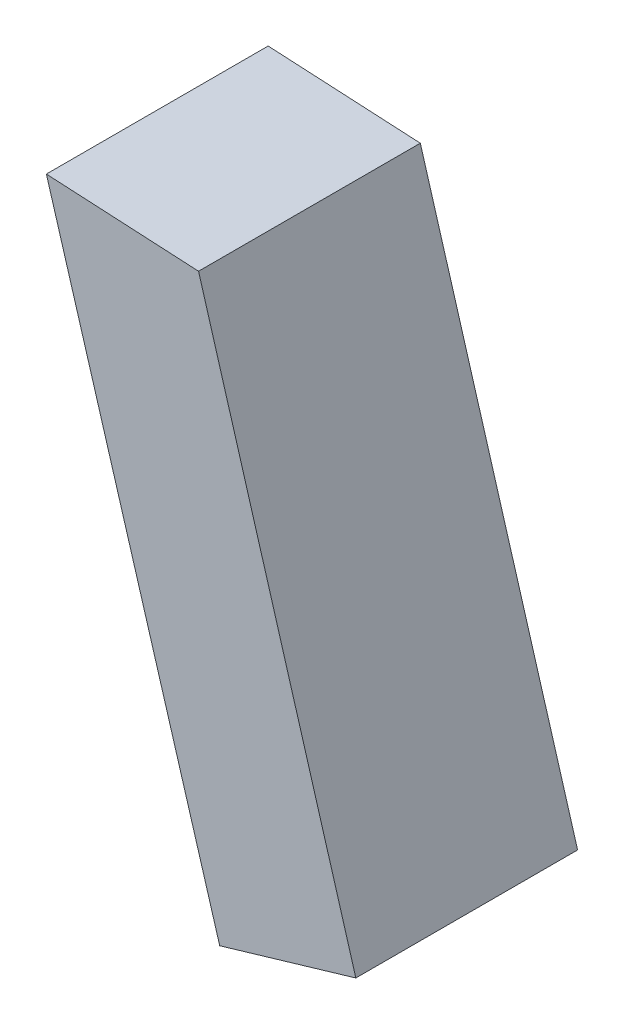
ISO-10303-21;
HEADER;
FILE_DESCRIPTION(('STEP AP214'),'2;1');
FILE_NAME('part.step','',(''),(''),'','','');
FILE_SCHEMA(('AUTOMOTIVE_DESIGN { 1 0 10303 214 1 1 1 1 }'));
ENDSEC;
DATA;
#1=APPLICATION_CONTEXT('core data for automotive mechanical design processes');
#2=APPLICATION_PROTOCOL_DEFINITION('international standard','automotive_design',2000,#1);
#3=PRODUCT_CONTEXT('',#1,'mechanical');
#4=PRODUCT('Part','Part','',(#3));
#5=PRODUCT_RELATED_PRODUCT_CATEGORY('part','',(#4));
#6=PRODUCT_DEFINITION_FORMATION('','',#4);
#7=PRODUCT_DEFINITION_CONTEXT('part definition',#1,'design');
#8=PRODUCT_DEFINITION('design','',#6,#7);
#9=PRODUCT_DEFINITION_SHAPE('','',#8);
#10=(LENGTH_UNIT() NAMED_UNIT(*) SI_UNIT(.MILLI.,.METRE.));
#11=(NAMED_UNIT(*) PLANE_ANGLE_UNIT() SI_UNIT($,.RADIAN.));
#12=(NAMED_UNIT(*) SI_UNIT($,.STERADIAN.) SOLID_ANGLE_UNIT());
#13=UNCERTAINTY_MEASURE_WITH_UNIT(LENGTH_MEASURE(1.E-05),#10,'distance_accuracy_value','');
#14=(GEOMETRIC_REPRESENTATION_CONTEXT(3) GLOBAL_UNCERTAINTY_ASSIGNED_CONTEXT((#13)) GLOBAL_UNIT_ASSIGNED_CONTEXT((#10,
#11,#12)) REPRESENTATION_CONTEXT('',''));
#15=CARTESIAN_POINT('',(0.,0.,0.));
#16=DIRECTION('',(0.,0.,1.));
#17=DIRECTION('',(1.,0.,0.));
#18=AXIS2_PLACEMENT_3D('',#15,#16,#17);
#19=CARTESIAN_POINT('',(1.33888275842864,0.973862852983506,0.125));
#20=DIRECTION('',(0.0530663955275407,0.998590986172875,0.));
#21=DIRECTION('',(-0.998590986172875,0.0530663955275407,0.));
#22=AXIS2_PLACEMENT_3D('',#19,#20,#21);
#23=PLANE('',#22);
#24=DIRECTION('',(0.998590986172875,-0.0530663955275407,0.));
#25=VECTOR('',#24,1.);
#26=CARTESIAN_POINT('',(1.33888275842864,0.973862852983506,-0.375));
#27=LINE('',#26,#25);
#28=CARTESIAN_POINT('',(1.33888275842864,0.973862852983506,-0.375));
#29=VERTEX_POINT('',#28);
#30=CARTESIAN_POINT('',(1.68191706925199,0.955633573258646,-0.375));
#31=VERTEX_POINT('',#30);
#32=EDGE_CURVE('E96',#29,#31,#27,.T.);
#33=ORIENTED_EDGE('',*,*,#32,.F.);
#34=DIRECTION('',(0.,0.,-1.));
#35=VECTOR('',#34,1.);
#36=CARTESIAN_POINT('',(1.33888275842864,0.973862852983506,0.125));
#37=LINE('',#36,#35);
#38=CARTESIAN_POINT('',(1.33888275842864,0.973862852983506,0.125));
#39=VERTEX_POINT('',#38);
#40=EDGE_CURVE('E11',#39,#29,#37,.T.);
#41=ORIENTED_EDGE('',*,*,#40,.F.);
#42=DIRECTION('',(0.998590986172875,-0.0530663955275407,0.));
#43=VECTOR('',#42,1.);
#44=CARTESIAN_POINT('',(1.33888275842864,0.973862852983506,0.125));
#45=LINE('',#44,#43);
#46=CARTESIAN_POINT('',(1.68191706925199,0.955633573258646,0.125));
#47=VERTEX_POINT('',#46);
#48=EDGE_CURVE('E90',#39,#47,#45,.T.);
#49=ORIENTED_EDGE('',*,*,#48,.T.);
#50=DIRECTION('',(0.,0.,-1.));
#51=VECTOR('',#50,1.);
#52=CARTESIAN_POINT('',(1.68191706925199,0.955633573258646,0.125));
#53=LINE('',#52,#51);
#54=EDGE_CURVE('E35',#47,#31,#53,.T.);
#55=ORIENTED_EDGE('',*,*,#54,.T.);
#56=EDGE_LOOP('',(#33,#41,#49,#55));
#57=FACE_BOUND('',#56,.T.);
#58=ADVANCED_FACE('F32',(#57),#23,.T.);
#59=CARTESIAN_POINT('',(1.72968641083679,-0.337503893167137,0.125));
#60=DIRECTION('',(-0.958348931660087,-0.285599939051059,0.));
#61=DIRECTION('',(0.285599939051059,-0.958348931660088,0.));
#62=AXIS2_PLACEMENT_3D('',#59,#60,#61);
#63=PLANE('',#62);
#64=DIRECTION('',(-0.285599939051059,0.958348931660087,0.));
#65=VECTOR('',#64,1.);
#66=CARTESIAN_POINT('',(1.72968641083679,-0.337503893167137,-0.375));
#67=LINE('',#66,#65);
#68=CARTESIAN_POINT('',(1.72968641083679,-0.337503893167137,-0.375));
#69=VERTEX_POINT('',#68);
#70=EDGE_CURVE('E92',#69,#29,#67,.T.);
#71=ORIENTED_EDGE('',*,*,#70,.F.);
#72=DIRECTION('',(0.,0.,-1.));
#73=VECTOR('',#72,1.);
#74=CARTESIAN_POINT('',(1.72968641083679,-0.337503893167137,0.125));
#75=LINE('',#74,#73);
#76=CARTESIAN_POINT('',(1.72968641083679,-0.337503893167137,0.125));
#77=VERTEX_POINT('',#76);
#78=EDGE_CURVE('E41',#77,#69,#75,.T.);
#79=ORIENTED_EDGE('',*,*,#78,.F.);
#80=DIRECTION('',(-0.285599939051059,0.958348931660087,0.));
#81=VECTOR('',#80,1.);
#82=CARTESIAN_POINT('',(1.72968641083679,-0.337503893167137,0.125));
#83=LINE('',#82,#81);
#84=EDGE_CURVE('E87',#77,#39,#83,.T.);
#85=ORIENTED_EDGE('',*,*,#84,.T.);
#86=ORIENTED_EDGE('',*,*,#40,.T.);
#87=EDGE_LOOP('',(#71,#79,#85,#86));
#88=FACE_BOUND('',#87,.T.);
#89=ADVANCED_FACE('F106',(#88),#63,.T.);
#90=CARTESIAN_POINT('',(2.03661499110323,-0.246978501062892,0.125));
#91=DIRECTION('',(0.282891850325768,-0.959151813332625,0.));
#92=DIRECTION('',(0.959151813332625,0.282891850325768,0.));
#93=AXIS2_PLACEMENT_3D('',#90,#91,#92);
#94=PLANE('',#93);
#95=DIRECTION('',(-0.959151813332625,-0.282891850325768,0.));
#96=VECTOR('',#95,1.);
#97=CARTESIAN_POINT('',(2.03661499110323,-0.246978501062892,-0.375));
#98=LINE('',#97,#96);
#99=CARTESIAN_POINT('',(2.03661499110323,-0.246978501062892,-0.375));
#100=VERTEX_POINT('',#99);
#101=EDGE_CURVE('E82',#100,#69,#98,.T.);
#102=ORIENTED_EDGE('',*,*,#101,.F.);
#103=DIRECTION('',(0.,0.,-1.));
#104=VECTOR('',#103,1.);
#105=CARTESIAN_POINT('',(2.03661499110323,-0.246978501062892,0.125));
#106=LINE('',#105,#104);
#107=CARTESIAN_POINT('',(2.03661499110323,-0.246978501062892,0.125));
#108=VERTEX_POINT('',#107);
#109=EDGE_CURVE('E77',#108,#100,#106,.T.);
#110=ORIENTED_EDGE('',*,*,#109,.F.);
#111=DIRECTION('',(-0.959151813332625,-0.282891850325768,0.));
#112=VECTOR('',#111,1.);
#113=CARTESIAN_POINT('',(2.03661499110323,-0.246978501062892,0.125));
#114=LINE('',#113,#112);
#115=EDGE_CURVE('E80',#108,#77,#114,.T.);
#116=ORIENTED_EDGE('',*,*,#115,.T.);
#117=ORIENTED_EDGE('',*,*,#78,.T.);
#118=EDGE_LOOP('',(#102,#110,#116,#117));
#119=FACE_BOUND('',#118,.T.);
#120=ADVANCED_FACE('F79',(#119),#94,.T.);
#121=CARTESIAN_POINT('',(1.68191706925199,0.955633573258646,0.125));
#122=DIRECTION('',(0.959151813332625,0.282891850325768,0.));
#123=DIRECTION('',(-0.282891850325768,0.959151813332625,0.));
#124=AXIS2_PLACEMENT_3D('',#121,#122,#123);
#125=PLANE('',#124);
#126=DIRECTION('',(0.282891850325768,-0.959151813332625,0.));
#127=VECTOR('',#126,1.);
#128=CARTESIAN_POINT('',(1.68191706925199,0.955633573258646,-0.375));
#129=LINE('',#128,#127);
#130=EDGE_CURVE('E99',#31,#100,#129,.T.);
#131=ORIENTED_EDGE('',*,*,#130,.F.);
#132=ORIENTED_EDGE('',*,*,#54,.F.);
#133=DIRECTION('',(0.282891850325768,-0.959151813332625,0.));
#134=VECTOR('',#133,1.);
#135=CARTESIAN_POINT('',(1.68191706925199,0.955633573258646,0.125));
#136=LINE('',#135,#134);
#137=EDGE_CURVE('E86',#47,#108,#136,.T.);
#138=ORIENTED_EDGE('',*,*,#137,.T.);
#139=ORIENTED_EDGE('',*,*,#109,.T.);
#140=EDGE_LOOP('',(#131,#132,#138,#139));
#141=FACE_BOUND('',#140,.T.);
#142=ADVANCED_FACE('F89',(#141),#125,.T.);
#143=CARTESIAN_POINT('',(0.,0.,0.125));
#144=DIRECTION('',(0.,0.,-1.));
#145=DIRECTION('',(-1.,0.,0.));
#146=AXIS2_PLACEMENT_3D('',#143,#144,#145);
#147=PLANE('',#146);
#148=ORIENTED_EDGE('',*,*,#48,.F.);
#149=ORIENTED_EDGE('',*,*,#84,.F.);
#150=ORIENTED_EDGE('',*,*,#115,.F.);
#151=ORIENTED_EDGE('',*,*,#137,.F.);
#152=EDGE_LOOP('',(#148,#149,#150,#151));
#153=FACE_BOUND('',#152,.T.);
#154=ADVANCED_FACE('F85',(#153),#147,.F.);
#155=CARTESIAN_POINT('',(0.,0.,-0.375));
#156=DIRECTION('',(0.,0.,-1.));
#157=DIRECTION('',(-1.,0.,0.));
#158=AXIS2_PLACEMENT_3D('',#155,#156,#157);
#159=PLANE('',#158);
#160=ORIENTED_EDGE('',*,*,#32,.T.);
#161=ORIENTED_EDGE('',*,*,#130,.T.);
#162=ORIENTED_EDGE('',*,*,#101,.T.);
#163=ORIENTED_EDGE('',*,*,#70,.T.);
#164=EDGE_LOOP('',(#160,#161,#162,#163));
#165=FACE_BOUND('',#164,.T.);
#166=ADVANCED_FACE('F105',(#165),#159,.T.);
#167=CLOSED_SHELL('',(#58,#89,#120,#142,#154,#166));
#168=MANIFOLD_SOLID_BREP('B2',#167);
#169=ADVANCED_BREP_SHAPE_REPRESENTATION('',(#18,#168),#14);
#170=SHAPE_DEFINITION_REPRESENTATION(#9,#169);
ENDSEC;
END-ISO-10303-21;
